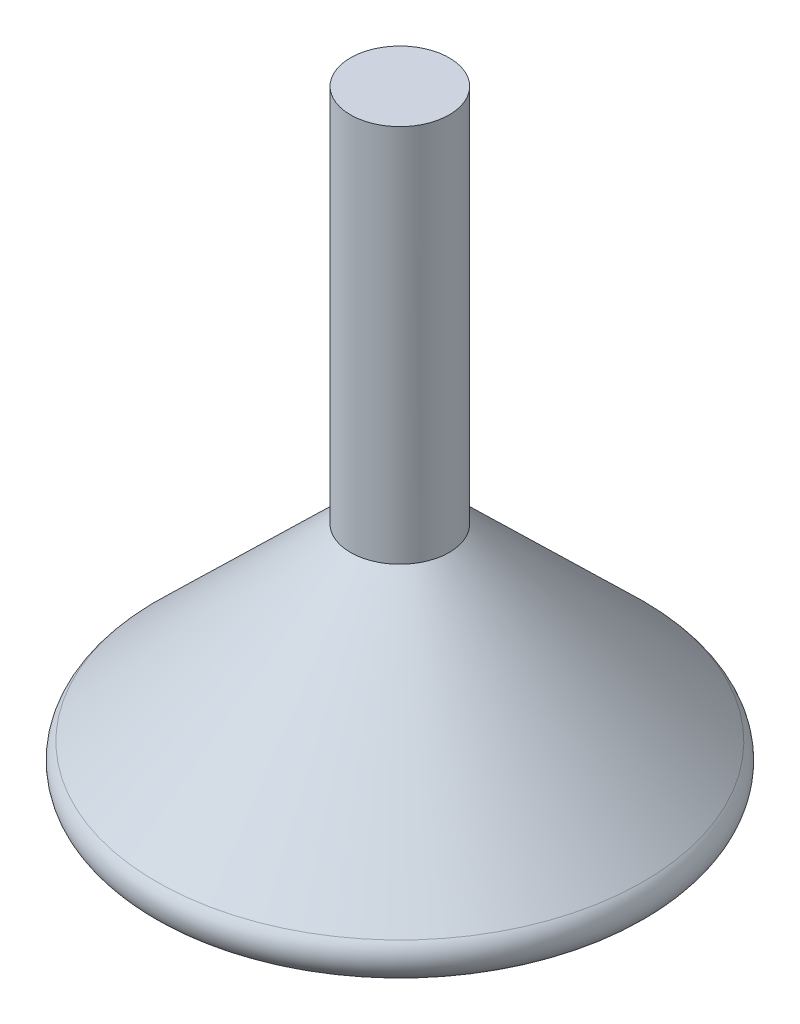
ISO-10303-21;
HEADER;
FILE_DESCRIPTION(('STEP AP214'),'2;1');
FILE_NAME('part.step','',(''),(''),'','','');
FILE_SCHEMA(('AUTOMOTIVE_DESIGN { 1 0 10303 214 1 1 1 1 }'));
ENDSEC;
DATA;
#1=APPLICATION_CONTEXT('core data for automotive mechanical design processes');
#2=APPLICATION_PROTOCOL_DEFINITION('international standard','automotive_design',2000,#1);
#3=PRODUCT_CONTEXT('',#1,'mechanical');
#4=PRODUCT('Part','Part','',(#3));
#5=PRODUCT_RELATED_PRODUCT_CATEGORY('part','',(#4));
#6=PRODUCT_DEFINITION_FORMATION('','',#4);
#7=PRODUCT_DEFINITION_CONTEXT('part definition',#1,'design');
#8=PRODUCT_DEFINITION('design','',#6,#7);
#9=PRODUCT_DEFINITION_SHAPE('','',#8);
#10=(LENGTH_UNIT() NAMED_UNIT(*) SI_UNIT(.MILLI.,.METRE.));
#11=(NAMED_UNIT(*) PLANE_ANGLE_UNIT() SI_UNIT($,.RADIAN.));
#12=(NAMED_UNIT(*) SI_UNIT($,.STERADIAN.) SOLID_ANGLE_UNIT());
#13=UNCERTAINTY_MEASURE_WITH_UNIT(LENGTH_MEASURE(1.E-05),#10,'distance_accuracy_value','');
#14=(GEOMETRIC_REPRESENTATION_CONTEXT(3) GLOBAL_UNCERTAINTY_ASSIGNED_CONTEXT((#13)) GLOBAL_UNIT_ASSIGNED_CONTEXT((#10,
#11,#12)) REPRESENTATION_CONTEXT('',''));
#15=CARTESIAN_POINT('',(0.,0.,0.));
#16=DIRECTION('',(0.,0.,1.));
#17=DIRECTION('',(1.,0.,0.));
#18=AXIS2_PLACEMENT_3D('',#15,#16,#17);
#19=CARTESIAN_POINT('',(30.,0.,0.));
#20=DIRECTION('',(0.,1.,0.));
#21=DIRECTION('',(0.,0.,1.));
#22=AXIS2_PLACEMENT_3D('',#19,#20,#21);
#23=PLANE('',#22);
#24=CARTESIAN_POINT('',(0.,0.,0.));
#25=DIRECTION('',(0.,-1.,0.));
#26=DIRECTION('',(0.,0.,-1.));
#27=AXIS2_PLACEMENT_3D('',#24,#25,#26);
#28=CIRCLE('',#27,30.);
#29=CARTESIAN_POINT('',(0.,0.,-30.));
#30=VERTEX_POINT('',#29);
#31=EDGE_CURVE('E40',#30,#30,#28,.T.);
#32=ORIENTED_EDGE('',*,*,#31,.T.);
#33=EDGE_LOOP('',(#32));
#34=FACE_BOUND('',#33,.T.);
#35=ADVANCED_FACE('F34',(#34),#23,.F.);
#36=CARTESIAN_POINT('',(0.,5.15163350808134,0.));
#37=DIRECTION('',(0.,-1.,0.));
#38=DIRECTION('',(0.,0.,-1.));
#39=AXIS2_PLACEMENT_3D('',#36,#37,#38);
#40=CONICAL_SURFACE('',#39,32.0905676853194,0.799792012876791);
#41=CARTESIAN_POINT('',(0.,30.,0.));
#42=DIRECTION('',(0.,1.,0.));
#43=DIRECTION('',(0.,0.,1.));
#44=AXIS2_PLACEMENT_3D('',#41,#42,#43);
#45=CIRCLE('',#44,6.51637635894298);
#46=CARTESIAN_POINT('',(0.,30.,6.51637635894298));
#47=VERTEX_POINT('',#46);
#48=EDGE_CURVE('E48',#47,#47,#45,.T.);
#49=ORIENTED_EDGE('',*,*,#48,.F.);
#50=EDGE_LOOP('',(#49));
#51=FACE_BOUND('',#50,.T.);
#52=CARTESIAN_POINT('',(0.,5.15163350808134,0.));
#53=DIRECTION('',(0.,-1.,0.));
#54=DIRECTION('',(0.,0.,-1.));
#55=AXIS2_PLACEMENT_3D('',#52,#53,#54);
#56=CIRCLE('',#55,32.0905676853194);
#57=CARTESIAN_POINT('',(0.,5.15163350808134,-32.0905676853194));
#58=VERTEX_POINT('',#57);
#59=EDGE_CURVE('E10',#58,#58,#56,.T.);
#60=ORIENTED_EDGE('',*,*,#59,.F.);
#61=EDGE_LOOP('',(#60));
#62=FACE_BOUND('',#61,.T.);
#63=ADVANCED_FACE('F56',(#51,#62),#40,.T.);
#64=CARTESIAN_POINT('',(0.,3.,0.));
#65=DIRECTION('',(0.,-1.,0.));
#66=DIRECTION('',(0.,0.,-1.));
#67=AXIS2_PLACEMENT_3D('',#64,#65,#66);
#68=TOROIDAL_SURFACE('',#67,30.,3.);
#69=ORIENTED_EDGE('',*,*,#31,.F.);
#70=EDGE_LOOP('',(#69));
#71=FACE_BOUND('',#70,.T.);
#72=ORIENTED_EDGE('',*,*,#59,.T.);
#73=EDGE_LOOP('',(#72));
#74=FACE_BOUND('',#73,.T.);
#75=ADVANCED_FACE('F59',(#71,#74),#68,.T.);
#76=CARTESIAN_POINT('',(0.,80.,0.));
#77=DIRECTION('',(0.,-1.,0.));
#78=DIRECTION('',(0.,0.,-1.));
#79=AXIS2_PLACEMENT_3D('',#76,#77,#78);
#80=CYLINDRICAL_SURFACE('',#79,6.51637635894298);
#81=CARTESIAN_POINT('',(0.,80.,0.));
#82=DIRECTION('',(0.,1.,0.));
#83=DIRECTION('',(0.,0.,1.));
#84=AXIS2_PLACEMENT_3D('',#81,#82,#83);
#85=CIRCLE('',#84,6.51637635894298);
#86=CARTESIAN_POINT('',(0.,80.,6.51637635894298));
#87=VERTEX_POINT('',#86);
#88=EDGE_CURVE('E44',#87,#87,#85,.T.);
#89=ORIENTED_EDGE('',*,*,#88,.F.);
#90=EDGE_LOOP('',(#89));
#91=FACE_BOUND('',#90,.T.);
#92=ORIENTED_EDGE('',*,*,#48,.T.);
#93=EDGE_LOOP('',(#92));
#94=FACE_BOUND('',#93,.T.);
#95=ADVANCED_FACE('F54',(#91,#94),#80,.T.);
#96=CARTESIAN_POINT('',(0.,80.,0.));
#97=DIRECTION('',(0.,1.,0.));
#98=DIRECTION('',(0.,0.,1.));
#99=AXIS2_PLACEMENT_3D('',#96,#97,#98);
#100=PLANE('',#99);
#101=ORIENTED_EDGE('',*,*,#88,.T.);
#102=EDGE_LOOP('',(#101));
#103=FACE_BOUND('',#102,.T.);
#104=ADVANCED_FACE('F69',(#103),#100,.T.);
#105=CLOSED_SHELL('',(#35,#63,#75,#95,#104));
#106=MANIFOLD_SOLID_BREP('B2',#105);
#107=ADVANCED_BREP_SHAPE_REPRESENTATION('',(#18,#106),#14);
#108=SHAPE_DEFINITION_REPRESENTATION(#9,#107);
ENDSEC;
END-ISO-10303-21;
